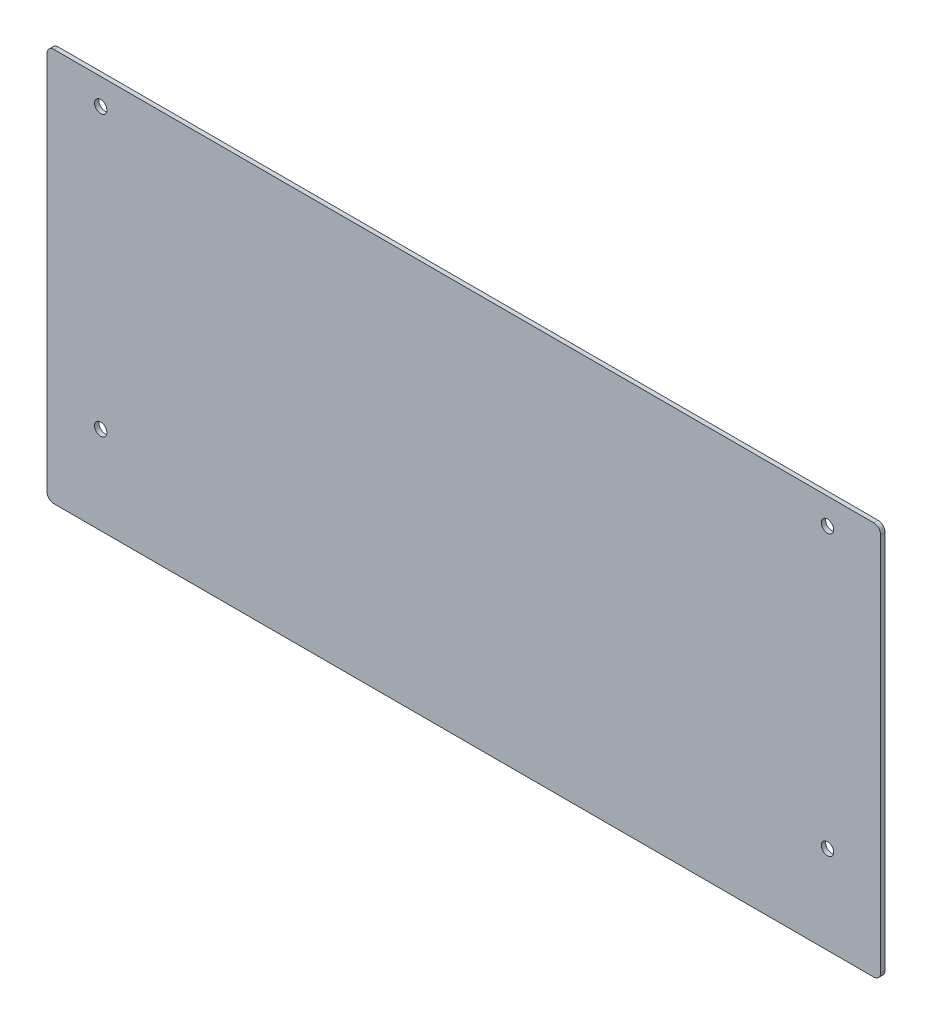
ISO-10303-21;
HEADER;
FILE_DESCRIPTION(('STEP AP214'),'2;1');
FILE_NAME('part.step','',(''),(''),'','','');
FILE_SCHEMA(('AUTOMOTIVE_DESIGN { 1 0 10303 214 1 1 1 1 }'));
ENDSEC;
DATA;
#1=APPLICATION_CONTEXT('core data for automotive mechanical design processes');
#2=APPLICATION_PROTOCOL_DEFINITION('international standard','automotive_design',2000,#1);
#3=PRODUCT_CONTEXT('',#1,'mechanical');
#4=PRODUCT('Part','Part','',(#3));
#5=PRODUCT_RELATED_PRODUCT_CATEGORY('part','',(#4));
#6=PRODUCT_DEFINITION_FORMATION('','',#4);
#7=PRODUCT_DEFINITION_CONTEXT('part definition',#1,'design');
#8=PRODUCT_DEFINITION('design','',#6,#7);
#9=PRODUCT_DEFINITION_SHAPE('','',#8);
#10=(LENGTH_UNIT() NAMED_UNIT(*) SI_UNIT(.MILLI.,.METRE.));
#11=(NAMED_UNIT(*) PLANE_ANGLE_UNIT() SI_UNIT($,.RADIAN.));
#12=(NAMED_UNIT(*) SI_UNIT($,.STERADIAN.) SOLID_ANGLE_UNIT());
#13=UNCERTAINTY_MEASURE_WITH_UNIT(LENGTH_MEASURE(1.E-05),#10,'distance_accuracy_value','');
#14=(GEOMETRIC_REPRESENTATION_CONTEXT(3) GLOBAL_UNCERTAINTY_ASSIGNED_CONTEXT((#13)) GLOBAL_UNIT_ASSIGNED_CONTEXT((#10,
#11,#12)) REPRESENTATION_CONTEXT('',''));
#15=CARTESIAN_POINT('',(0.,0.,0.));
#16=DIRECTION('',(0.,0.,1.));
#17=DIRECTION('',(1.,0.,0.));
#18=AXIS2_PLACEMENT_3D('',#15,#16,#17);
#19=CARTESIAN_POINT('',(0.,0.,1.5875));
#20=DIRECTION('',(0.,0.,-1.));
#21=DIRECTION('',(-1.,0.,0.));
#22=AXIS2_PLACEMENT_3D('',#19,#20,#21);
#23=PLANE('',#22);
#24=CARTESIAN_POINT('',(30.1060674486225,-170.952944132923,1.5875));
#25=DIRECTION('',(0.,0.,1.));
#26=DIRECTION('',(1.,0.,0.));
#27=AXIS2_PLACEMENT_3D('',#24,#25,#26);
#28=CIRCLE('',#27,2.25);
#29=CARTESIAN_POINT('',(32.3560674486225,-170.952944132923,1.5875));
#30=VERTEX_POINT('',#29);
#31=EDGE_CURVE('E201',#30,#30,#28,.T.);
#32=ORIENTED_EDGE('',*,*,#31,.F.);
#33=EDGE_LOOP('',(#32));
#34=FACE_BOUND('',#33,.T.);
#35=CARTESIAN_POINT('',(30.1060674486197,-272.978890964055,1.5875));
#36=DIRECTION('',(0.,0.,1.));
#37=DIRECTION('',(1.,0.,0.));
#38=AXIS2_PLACEMENT_3D('',#35,#36,#37);
#39=CIRCLE('',#38,2.25);
#40=CARTESIAN_POINT('',(32.3560674486197,-272.978890964055,1.5875));
#41=VERTEX_POINT('',#40);
#42=EDGE_CURVE('E195',#41,#41,#39,.T.);
#43=ORIENTED_EDGE('',*,*,#42,.F.);
#44=EDGE_LOOP('',(#43));
#45=FACE_BOUND('',#44,.T.);
#46=CARTESIAN_POINT('',(295.536067448617,-170.952944132512,1.5875));
#47=DIRECTION('',(0.,0.,1.));
#48=DIRECTION('',(1.,0.,0.));
#49=AXIS2_PLACEMENT_3D('',#46,#47,#48);
#50=CIRCLE('',#49,2.24999999999997);
#51=CARTESIAN_POINT('',(297.786067448617,-170.952944132512,1.5875));
#52=VERTEX_POINT('',#51);
#53=EDGE_CURVE('E189',#52,#52,#50,.T.);
#54=ORIENTED_EDGE('',*,*,#53,.F.);
#55=EDGE_LOOP('',(#54));
#56=FACE_BOUND('',#55,.T.);
#57=CARTESIAN_POINT('',(295.536067448761,-272.978890963911,1.5875));
#58=DIRECTION('',(0.,0.,1.));
#59=DIRECTION('',(1.,0.,0.));
#60=AXIS2_PLACEMENT_3D('',#57,#58,#59);
#61=CIRCLE('',#60,2.24999999999997);
#62=CARTESIAN_POINT('',(297.786067448761,-272.978890963911,1.5875));
#63=VERTEX_POINT('',#62);
#64=EDGE_CURVE('E183',#63,#63,#61,.T.);
#65=ORIENTED_EDGE('',*,*,#64,.F.);
#66=EDGE_LOOP('',(#65));
#67=FACE_BOUND('',#66,.T.);
#68=DIRECTION('',(0.,-1.,0.));
#69=VECTOR('',#68,1.);
#70=CARTESIAN_POINT('',(10.4879414326296,-305.121117694509,1.5875));
#71=LINE('',#70,#69);
#72=CARTESIAN_POINT('',(10.4879414326296,-163.967917548281,1.5875));
#73=VERTEX_POINT('',#72);
#74=CARTESIAN_POINT('',(10.4879414326296,-302.581117694509,1.5875));
#75=VERTEX_POINT('',#74);
#76=EDGE_CURVE('E141',#73,#75,#71,.T.);
#77=ORIENTED_EDGE('',*,*,#76,.T.);
#78=CARTESIAN_POINT('',(13.0279414326296,-302.581117694509,1.5875));
#79=DIRECTION('',(0.,0.,-1.));
#80=DIRECTION('',(-1.,0.,0.));
#81=AXIS2_PLACEMENT_3D('',#78,#79,#80);
#82=CIRCLE('',#81,2.54);
#83=CARTESIAN_POINT('',(13.0279414326296,-305.121117694509,1.5875));
#84=VERTEX_POINT('',#83);
#85=EDGE_CURVE('E156',#75,#84,#82,.F.);
#86=ORIENTED_EDGE('',*,*,#85,.T.);
#87=DIRECTION('',(1.,0.,0.));
#88=VECTOR('',#87,1.);
#89=CARTESIAN_POINT('',(10.4879414326296,-305.121117694509,1.5875));
#90=LINE('',#89,#88);
#91=CARTESIAN_POINT('',(312.426067450788,-305.121117694509,1.5875));
#92=VERTEX_POINT('',#91);
#93=EDGE_CURVE('E124',#84,#92,#90,.T.);
#94=ORIENTED_EDGE('',*,*,#93,.T.);
#95=CARTESIAN_POINT('',(312.426067450788,-302.581117694509,1.5875));
#96=DIRECTION('',(0.,0.,-1.));
#97=DIRECTION('',(-1.,0.,0.));
#98=AXIS2_PLACEMENT_3D('',#95,#96,#97);
#99=CIRCLE('',#98,2.54);
#100=CARTESIAN_POINT('',(314.966067450788,-302.581117694509,1.5875));
#101=VERTEX_POINT('',#100);
#102=EDGE_CURVE('E151',#92,#101,#99,.F.);
#103=ORIENTED_EDGE('',*,*,#102,.T.);
#104=DIRECTION('',(0.,1.,0.));
#105=VECTOR('',#104,1.);
#106=CARTESIAN_POINT('',(314.966067450788,-305.121117694509,1.5875));
#107=LINE('',#106,#105);
#108=CARTESIAN_POINT('',(314.966067450788,-163.967917548281,1.5875));
#109=VERTEX_POINT('',#108);
#110=EDGE_CURVE('E167',#101,#109,#107,.T.);
#111=ORIENTED_EDGE('',*,*,#110,.T.);
#112=CARTESIAN_POINT('',(312.426067450788,-163.967917548281,1.5875));
#113=DIRECTION('',(0.,0.,-1.));
#114=DIRECTION('',(-1.,0.,0.));
#115=AXIS2_PLACEMENT_3D('',#112,#113,#114);
#116=CIRCLE('',#115,2.54);
#117=CARTESIAN_POINT('',(312.426067450788,-161.427917548281,1.5875));
#118=VERTEX_POINT('',#117);
#119=EDGE_CURVE('E60',#109,#118,#116,.F.);
#120=ORIENTED_EDGE('',*,*,#119,.T.);
#121=DIRECTION('',(-1.,0.,0.));
#122=VECTOR('',#121,1.);
#123=CARTESIAN_POINT('',(10.4879414326296,-161.427917548281,1.5875));
#124=LINE('',#123,#122);
#125=CARTESIAN_POINT('',(13.0279414326296,-161.427917548281,1.5875));
#126=VERTEX_POINT('',#125);
#127=EDGE_CURVE('E142',#118,#126,#124,.T.);
#128=ORIENTED_EDGE('',*,*,#127,.T.);
#129=CARTESIAN_POINT('',(13.0279414326296,-163.967917548281,1.5875));
#130=DIRECTION('',(0.,0.,-1.));
#131=DIRECTION('',(-1.,0.,0.));
#132=AXIS2_PLACEMENT_3D('',#129,#130,#131);
#133=CIRCLE('',#132,2.54);
#134=EDGE_CURVE('E154',#126,#73,#133,.F.);
#135=ORIENTED_EDGE('',*,*,#134,.T.);
#136=EDGE_LOOP('',(#77,#86,#94,#103,#111,#120,#128,#135));
#137=FACE_BOUND('',#136,.T.);
#138=ADVANCED_FACE('F38',(#34,#45,#56,#67,#137),#23,.F.);
#139=CARTESIAN_POINT('',(0.,0.,0.));
#140=DIRECTION('',(0.,0.,-1.));
#141=DIRECTION('',(-1.,0.,0.));
#142=AXIS2_PLACEMENT_3D('',#139,#140,#141);
#143=PLANE('',#142);
#144=CARTESIAN_POINT('',(30.1060674486225,-170.952944132923,0.));
#145=DIRECTION('',(0.,0.,1.));
#146=DIRECTION('',(1.,0.,0.));
#147=AXIS2_PLACEMENT_3D('',#144,#145,#146);
#148=CIRCLE('',#147,2.25);
#149=CARTESIAN_POINT('',(32.3560674486225,-170.952944132923,0.));
#150=VERTEX_POINT('',#149);
#151=EDGE_CURVE('E198',#150,#150,#148,.T.);
#152=ORIENTED_EDGE('',*,*,#151,.T.);
#153=EDGE_LOOP('',(#152));
#154=FACE_BOUND('',#153,.T.);
#155=CARTESIAN_POINT('',(30.1060674486197,-272.978890964055,0.));
#156=DIRECTION('',(0.,0.,1.));
#157=DIRECTION('',(1.,0.,0.));
#158=AXIS2_PLACEMENT_3D('',#155,#156,#157);
#159=CIRCLE('',#158,2.25);
#160=CARTESIAN_POINT('',(32.3560674486197,-272.978890964055,0.));
#161=VERTEX_POINT('',#160);
#162=EDGE_CURVE('E192',#161,#161,#159,.T.);
#163=ORIENTED_EDGE('',*,*,#162,.T.);
#164=EDGE_LOOP('',(#163));
#165=FACE_BOUND('',#164,.T.);
#166=CARTESIAN_POINT('',(295.536067448617,-170.952944132512,0.));
#167=DIRECTION('',(0.,0.,1.));
#168=DIRECTION('',(1.,0.,0.));
#169=AXIS2_PLACEMENT_3D('',#166,#167,#168);
#170=CIRCLE('',#169,2.24999999999997);
#171=CARTESIAN_POINT('',(297.786067448617,-170.952944132512,0.));
#172=VERTEX_POINT('',#171);
#173=EDGE_CURVE('E186',#172,#172,#170,.T.);
#174=ORIENTED_EDGE('',*,*,#173,.T.);
#175=EDGE_LOOP('',(#174));
#176=FACE_BOUND('',#175,.T.);
#177=CARTESIAN_POINT('',(295.536067448761,-272.978890963911,0.));
#178=DIRECTION('',(0.,0.,1.));
#179=DIRECTION('',(1.,0.,0.));
#180=AXIS2_PLACEMENT_3D('',#177,#178,#179);
#181=CIRCLE('',#180,2.24999999999997);
#182=CARTESIAN_POINT('',(297.786067448761,-272.978890963911,0.));
#183=VERTEX_POINT('',#182);
#184=EDGE_CURVE('E136',#183,#183,#181,.T.);
#185=ORIENTED_EDGE('',*,*,#184,.T.);
#186=EDGE_LOOP('',(#185));
#187=FACE_BOUND('',#186,.T.);
#188=DIRECTION('',(1.,0.,0.));
#189=VECTOR('',#188,1.);
#190=CARTESIAN_POINT('',(10.4879414326296,-305.121117694509,0.));
#191=LINE('',#190,#189);
#192=CARTESIAN_POINT('',(13.0279414326296,-305.121117694509,0.));
#193=VERTEX_POINT('',#192);
#194=CARTESIAN_POINT('',(312.426067450788,-305.121117694509,0.));
#195=VERTEX_POINT('',#194);
#196=EDGE_CURVE('E121',#193,#195,#191,.T.);
#197=ORIENTED_EDGE('',*,*,#196,.F.);
#198=CARTESIAN_POINT('',(13.0279414326296,-302.581117694509,0.));
#199=DIRECTION('',(0.,0.,-1.));
#200=DIRECTION('',(-1.,0.,0.));
#201=AXIS2_PLACEMENT_3D('',#198,#199,#200);
#202=CIRCLE('',#201,2.54);
#203=CARTESIAN_POINT('',(10.4879414326296,-302.581117694509,0.));
#204=VERTEX_POINT('',#203);
#205=EDGE_CURVE('E104',#193,#204,#202,.T.);
#206=ORIENTED_EDGE('',*,*,#205,.T.);
#207=DIRECTION('',(0.,-1.,0.));
#208=VECTOR('',#207,1.);
#209=CARTESIAN_POINT('',(10.4879414326296,-305.121117694509,0.));
#210=LINE('',#209,#208);
#211=CARTESIAN_POINT('',(10.4879414326296,-163.967917548281,0.));
#212=VERTEX_POINT('',#211);
#213=EDGE_CURVE('E131',#212,#204,#210,.T.);
#214=ORIENTED_EDGE('',*,*,#213,.F.);
#215=CARTESIAN_POINT('',(13.0279414326296,-163.967917548281,0.));
#216=DIRECTION('',(0.,0.,-1.));
#217=DIRECTION('',(-1.,0.,0.));
#218=AXIS2_PLACEMENT_3D('',#215,#216,#217);
#219=CIRCLE('',#218,2.54);
#220=CARTESIAN_POINT('',(13.0279414326296,-161.427917548281,0.));
#221=VERTEX_POINT('',#220);
#222=EDGE_CURVE('E115',#212,#221,#219,.T.);
#223=ORIENTED_EDGE('',*,*,#222,.T.);
#224=DIRECTION('',(-1.,0.,0.));
#225=VECTOR('',#224,1.);
#226=CARTESIAN_POINT('',(10.4879414326296,-161.427917548281,0.));
#227=LINE('',#226,#225);
#228=CARTESIAN_POINT('',(312.426067450788,-161.427917548281,0.));
#229=VERTEX_POINT('',#228);
#230=EDGE_CURVE('E134',#229,#221,#227,.T.);
#231=ORIENTED_EDGE('',*,*,#230,.F.);
#232=CARTESIAN_POINT('',(312.426067450788,-163.967917548281,0.));
#233=DIRECTION('',(0.,0.,-1.));
#234=DIRECTION('',(-1.,0.,0.));
#235=AXIS2_PLACEMENT_3D('',#232,#233,#234);
#236=CIRCLE('',#235,2.54);
#237=CARTESIAN_POINT('',(314.966067450788,-163.967917548281,0.));
#238=VERTEX_POINT('',#237);
#239=EDGE_CURVE('E145',#229,#238,#236,.T.);
#240=ORIENTED_EDGE('',*,*,#239,.T.);
#241=DIRECTION('',(0.,1.,0.));
#242=VECTOR('',#241,1.);
#243=CARTESIAN_POINT('',(314.966067450788,-305.121117694509,0.));
#244=LINE('',#243,#242);
#245=CARTESIAN_POINT('',(314.966067450788,-302.581117694509,0.));
#246=VERTEX_POINT('',#245);
#247=EDGE_CURVE('E130',#246,#238,#244,.T.);
#248=ORIENTED_EDGE('',*,*,#247,.F.);
#249=CARTESIAN_POINT('',(312.426067450788,-302.581117694509,0.));
#250=DIRECTION('',(0.,0.,-1.));
#251=DIRECTION('',(-1.,0.,0.));
#252=AXIS2_PLACEMENT_3D('',#249,#250,#251);
#253=CIRCLE('',#252,2.54);
#254=EDGE_CURVE('E125',#246,#195,#253,.T.);
#255=ORIENTED_EDGE('',*,*,#254,.T.);
#256=EDGE_LOOP('',(#197,#206,#214,#223,#231,#240,#248,#255));
#257=FACE_BOUND('',#256,.T.);
#258=ADVANCED_FACE('F128',(#154,#165,#176,#187,#257),#143,.T.);
#259=CARTESIAN_POINT('',(10.4879414326296,-305.121117694509,1.5875));
#260=DIRECTION('',(1.,0.,0.));
#261=DIRECTION('',(0.,0.,-1.));
#262=AXIS2_PLACEMENT_3D('',#259,#260,#261);
#263=PLANE('',#262);
#264=ORIENTED_EDGE('',*,*,#213,.T.);
#265=DIRECTION('',(0.,0.,-1.));
#266=VECTOR('',#265,1.);
#267=CARTESIAN_POINT('',(10.4879414326296,-302.581117694509,1.5875));
#268=LINE('',#267,#266);
#269=EDGE_CURVE('E109',#204,#75,#268,.F.);
#270=ORIENTED_EDGE('',*,*,#269,.T.);
#271=ORIENTED_EDGE('',*,*,#76,.F.);
#272=DIRECTION('',(0.,0.,-1.));
#273=VECTOR('',#272,1.);
#274=CARTESIAN_POINT('',(10.4879414326296,-163.967917548281,1.5875));
#275=LINE('',#274,#273);
#276=EDGE_CURVE('E114',#73,#212,#275,.T.);
#277=ORIENTED_EDGE('',*,*,#276,.T.);
#278=EDGE_LOOP('',(#264,#270,#271,#277));
#279=FACE_BOUND('',#278,.T.);
#280=ADVANCED_FACE('F218',(#279),#263,.F.);
#281=CARTESIAN_POINT('',(10.4879414326296,-305.121117694509,1.5875));
#282=DIRECTION('',(0.,1.,0.));
#283=DIRECTION('',(0.,0.,1.));
#284=AXIS2_PLACEMENT_3D('',#281,#282,#283);
#285=PLANE('',#284);
#286=ORIENTED_EDGE('',*,*,#93,.F.);
#287=DIRECTION('',(0.,0.,-1.));
#288=VECTOR('',#287,1.);
#289=CARTESIAN_POINT('',(13.0279414326296,-305.121117694509,1.5875));
#290=LINE('',#289,#288);
#291=EDGE_CURVE('E108',#84,#193,#290,.T.);
#292=ORIENTED_EDGE('',*,*,#291,.T.);
#293=ORIENTED_EDGE('',*,*,#196,.T.);
#294=DIRECTION('',(0.,0.,-1.));
#295=VECTOR('',#294,1.);
#296=CARTESIAN_POINT('',(312.426067450788,-305.121117694509,1.5875));
#297=LINE('',#296,#295);
#298=EDGE_CURVE('E126',#195,#92,#297,.F.);
#299=ORIENTED_EDGE('',*,*,#298,.T.);
#300=EDGE_LOOP('',(#286,#292,#293,#299));
#301=FACE_BOUND('',#300,.T.);
#302=ADVANCED_FACE('F120',(#301),#285,.F.);
#303=CARTESIAN_POINT('',(314.966067450788,-305.121117694509,1.5875));
#304=DIRECTION('',(-1.,0.,0.));
#305=DIRECTION('',(0.,0.,1.));
#306=AXIS2_PLACEMENT_3D('',#303,#304,#305);
#307=PLANE('',#306);
#308=ORIENTED_EDGE('',*,*,#247,.T.);
#309=DIRECTION('',(0.,0.,-1.));
#310=VECTOR('',#309,1.);
#311=CARTESIAN_POINT('',(314.966067450788,-163.967917548281,1.5875));
#312=LINE('',#311,#310);
#313=EDGE_CURVE('E11',#238,#109,#312,.F.);
#314=ORIENTED_EDGE('',*,*,#313,.T.);
#315=ORIENTED_EDGE('',*,*,#110,.F.);
#316=DIRECTION('',(0.,0.,-1.));
#317=VECTOR('',#316,1.);
#318=CARTESIAN_POINT('',(314.966067450788,-302.581117694509,1.5875));
#319=LINE('',#318,#317);
#320=EDGE_CURVE('E46',#101,#246,#319,.T.);
#321=ORIENTED_EDGE('',*,*,#320,.T.);
#322=EDGE_LOOP('',(#308,#314,#315,#321));
#323=FACE_BOUND('',#322,.T.);
#324=ADVANCED_FACE('F165',(#323),#307,.F.);
#325=CARTESIAN_POINT('',(10.4879414326296,-161.427917548281,1.5875));
#326=DIRECTION('',(0.,-1.,0.));
#327=DIRECTION('',(0.,0.,-1.));
#328=AXIS2_PLACEMENT_3D('',#325,#326,#327);
#329=PLANE('',#328);
#330=ORIENTED_EDGE('',*,*,#230,.T.);
#331=DIRECTION('',(0.,0.,-1.));
#332=VECTOR('',#331,1.);
#333=CARTESIAN_POINT('',(13.0279414326296,-161.427917548281,1.5875));
#334=LINE('',#333,#332);
#335=EDGE_CURVE('E53',#221,#126,#334,.F.);
#336=ORIENTED_EDGE('',*,*,#335,.T.);
#337=ORIENTED_EDGE('',*,*,#127,.F.);
#338=DIRECTION('',(0.,0.,-1.));
#339=VECTOR('',#338,1.);
#340=CARTESIAN_POINT('',(312.426067450788,-161.427917548281,1.5875));
#341=LINE('',#340,#339);
#342=EDGE_CURVE('E158',#118,#229,#341,.T.);
#343=ORIENTED_EDGE('',*,*,#342,.T.);
#344=EDGE_LOOP('',(#330,#336,#337,#343));
#345=FACE_BOUND('',#344,.T.);
#346=ADVANCED_FACE('F174',(#345),#329,.F.);
#347=CARTESIAN_POINT('',(13.0279414326296,-302.581117694509,1.5875));
#348=DIRECTION('',(0.,0.,-1.));
#349=DIRECTION('',(-1.,0.,0.));
#350=AXIS2_PLACEMENT_3D('',#347,#348,#349);
#351=CYLINDRICAL_SURFACE('',#350,2.54);
#352=ORIENTED_EDGE('',*,*,#85,.F.);
#353=ORIENTED_EDGE('',*,*,#269,.F.);
#354=ORIENTED_EDGE('',*,*,#205,.F.);
#355=ORIENTED_EDGE('',*,*,#291,.F.);
#356=EDGE_LOOP('',(#352,#353,#354,#355));
#357=FACE_BOUND('',#356,.T.);
#358=ADVANCED_FACE('F107',(#357),#351,.T.);
#359=CARTESIAN_POINT('',(13.0279414326296,-163.967917548281,1.5875));
#360=DIRECTION('',(0.,0.,-1.));
#361=DIRECTION('',(-1.,0.,0.));
#362=AXIS2_PLACEMENT_3D('',#359,#360,#361);
#363=CYLINDRICAL_SURFACE('',#362,2.54);
#364=ORIENTED_EDGE('',*,*,#134,.F.);
#365=ORIENTED_EDGE('',*,*,#335,.F.);
#366=ORIENTED_EDGE('',*,*,#222,.F.);
#367=ORIENTED_EDGE('',*,*,#276,.F.);
#368=EDGE_LOOP('',(#364,#365,#366,#367));
#369=FACE_BOUND('',#368,.T.);
#370=ADVANCED_FACE('F220',(#369),#363,.T.);
#371=CARTESIAN_POINT('',(312.426067450788,-163.967917548281,1.5875));
#372=DIRECTION('',(0.,0.,-1.));
#373=DIRECTION('',(-1.,0.,0.));
#374=AXIS2_PLACEMENT_3D('',#371,#372,#373);
#375=CYLINDRICAL_SURFACE('',#374,2.54);
#376=ORIENTED_EDGE('',*,*,#119,.F.);
#377=ORIENTED_EDGE('',*,*,#313,.F.);
#378=ORIENTED_EDGE('',*,*,#239,.F.);
#379=ORIENTED_EDGE('',*,*,#342,.F.);
#380=EDGE_LOOP('',(#376,#377,#378,#379));
#381=FACE_BOUND('',#380,.T.);
#382=ADVANCED_FACE('F173',(#381),#375,.T.);
#383=CARTESIAN_POINT('',(312.426067450788,-302.581117694509,1.5875));
#384=DIRECTION('',(0.,0.,-1.));
#385=DIRECTION('',(-1.,0.,0.));
#386=AXIS2_PLACEMENT_3D('',#383,#384,#385);
#387=CYLINDRICAL_SURFACE('',#386,2.54);
#388=ORIENTED_EDGE('',*,*,#102,.F.);
#389=ORIENTED_EDGE('',*,*,#298,.F.);
#390=ORIENTED_EDGE('',*,*,#254,.F.);
#391=ORIENTED_EDGE('',*,*,#320,.F.);
#392=EDGE_LOOP('',(#388,#389,#390,#391));
#393=FACE_BOUND('',#392,.T.);
#394=ADVANCED_FACE('F40',(#393),#387,.T.);
#395=CARTESIAN_POINT('',(295.536067448761,-272.978890963911,1.5875));
#396=DIRECTION('',(0.,0.,1.));
#397=DIRECTION('',(1.,0.,0.));
#398=AXIS2_PLACEMENT_3D('',#395,#396,#397);
#399=CYLINDRICAL_SURFACE('',#398,2.24999999999997);
#400=ORIENTED_EDGE('',*,*,#184,.F.);
#401=EDGE_LOOP('',(#400));
#402=FACE_BOUND('',#401,.T.);
#403=ORIENTED_EDGE('',*,*,#64,.T.);
#404=EDGE_LOOP('',(#403));
#405=FACE_BOUND('',#404,.T.);
#406=ADVANCED_FACE('F240',(#402,#405),#399,.F.);
#407=CARTESIAN_POINT('',(295.536067448617,-170.952944132512,1.5875));
#408=DIRECTION('',(0.,0.,1.));
#409=DIRECTION('',(1.,0.,0.));
#410=AXIS2_PLACEMENT_3D('',#407,#408,#409);
#411=CYLINDRICAL_SURFACE('',#410,2.24999999999997);
#412=ORIENTED_EDGE('',*,*,#173,.F.);
#413=EDGE_LOOP('',(#412));
#414=FACE_BOUND('',#413,.T.);
#415=ORIENTED_EDGE('',*,*,#53,.T.);
#416=EDGE_LOOP('',(#415));
#417=FACE_BOUND('',#416,.T.);
#418=ADVANCED_FACE('F243',(#414,#417),#411,.F.);
#419=CARTESIAN_POINT('',(30.1060674486197,-272.978890964055,1.5875));
#420=DIRECTION('',(0.,0.,1.));
#421=DIRECTION('',(1.,0.,0.));
#422=AXIS2_PLACEMENT_3D('',#419,#420,#421);
#423=CYLINDRICAL_SURFACE('',#422,2.25);
#424=ORIENTED_EDGE('',*,*,#162,.F.);
#425=EDGE_LOOP('',(#424));
#426=FACE_BOUND('',#425,.T.);
#427=ORIENTED_EDGE('',*,*,#42,.T.);
#428=EDGE_LOOP('',(#427));
#429=FACE_BOUND('',#428,.T.);
#430=ADVANCED_FACE('F247',(#426,#429),#423,.F.);
#431=CARTESIAN_POINT('',(30.1060674486225,-170.952944132923,1.5875));
#432=DIRECTION('',(0.,0.,1.));
#433=DIRECTION('',(1.,0.,0.));
#434=AXIS2_PLACEMENT_3D('',#431,#432,#433);
#435=CYLINDRICAL_SURFACE('',#434,2.25);
#436=ORIENTED_EDGE('',*,*,#151,.F.);
#437=EDGE_LOOP('',(#436));
#438=FACE_BOUND('',#437,.T.);
#439=ORIENTED_EDGE('',*,*,#31,.T.);
#440=EDGE_LOOP('',(#439));
#441=FACE_BOUND('',#440,.T.);
#442=ADVANCED_FACE('F205',(#438,#441),#435,.F.);
#443=CLOSED_SHELL('',(#138,#258,#280,#302,#324,#346,#358,#370,#382,#394,#406,#418,#430,#442));
#444=MANIFOLD_SOLID_BREP('B2',#443);
#445=ADVANCED_BREP_SHAPE_REPRESENTATION('',(#18,#444),#14);
#446=SHAPE_DEFINITION_REPRESENTATION(#9,#445);
ENDSEC;
END-ISO-10303-21;
